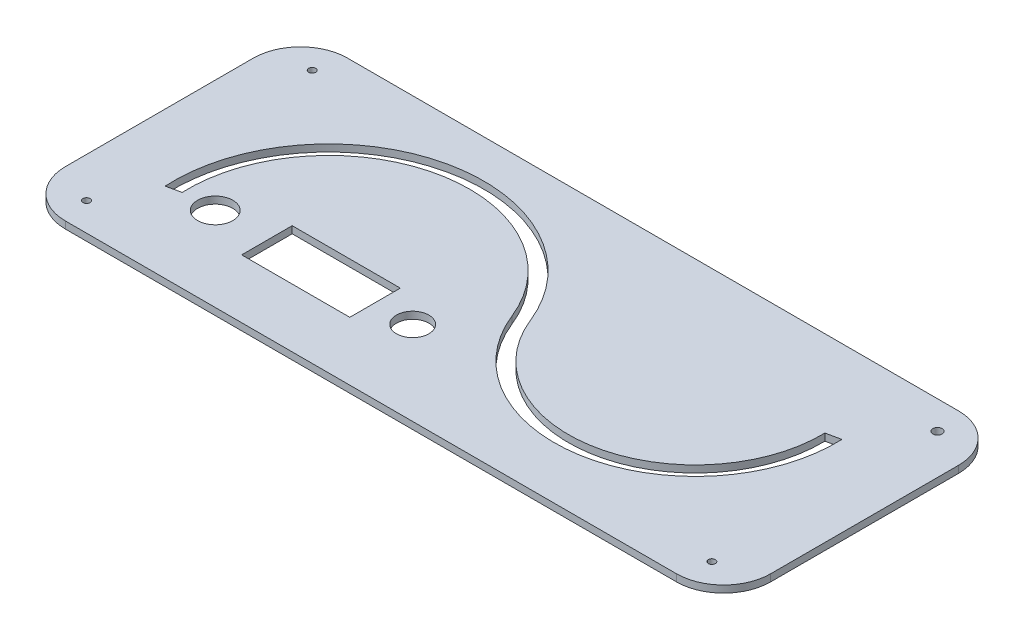
ISO-10303-21;
HEADER;
FILE_DESCRIPTION(('STEP AP214'),'2;1');
FILE_NAME('part.step','',(''),(''),'','','');
FILE_SCHEMA(('AUTOMOTIVE_DESIGN { 1 0 10303 214 1 1 1 1 }'));
ENDSEC;
DATA;
#1=APPLICATION_CONTEXT('core data for automotive mechanical design processes');
#2=APPLICATION_PROTOCOL_DEFINITION('international standard','automotive_design',2000,#1);
#3=PRODUCT_CONTEXT('',#1,'mechanical');
#4=PRODUCT('Part','Part','',(#3));
#5=PRODUCT_RELATED_PRODUCT_CATEGORY('part','',(#4));
#6=PRODUCT_DEFINITION_FORMATION('','',#4);
#7=PRODUCT_DEFINITION_CONTEXT('part definition',#1,'design');
#8=PRODUCT_DEFINITION('design','',#6,#7);
#9=PRODUCT_DEFINITION_SHAPE('','',#8);
#10=(LENGTH_UNIT() NAMED_UNIT(*) SI_UNIT(.MILLI.,.METRE.));
#11=(NAMED_UNIT(*) PLANE_ANGLE_UNIT() SI_UNIT($,.RADIAN.));
#12=(NAMED_UNIT(*) SI_UNIT($,.STERADIAN.) SOLID_ANGLE_UNIT());
#13=UNCERTAINTY_MEASURE_WITH_UNIT(LENGTH_MEASURE(1.E-05),#10,'distance_accuracy_value','');
#14=(GEOMETRIC_REPRESENTATION_CONTEXT(3) GLOBAL_UNCERTAINTY_ASSIGNED_CONTEXT((#13)) GLOBAL_UNIT_ASSIGNED_CONTEXT((#10,
#11,#12)) REPRESENTATION_CONTEXT('',''));
#15=CARTESIAN_POINT('',(0.,0.,0.));
#16=DIRECTION('',(0.,0.,1.));
#17=DIRECTION('',(1.,0.,0.));
#18=AXIS2_PLACEMENT_3D('',#15,#16,#17);
#19=CARTESIAN_POINT('',(0.,3.,0.));
#20=DIRECTION('',(0.,1.,0.));
#21=DIRECTION('',(0.,0.,1.));
#22=AXIS2_PLACEMENT_3D('',#19,#20,#21);
#23=PLANE('',#22);
#24=CARTESIAN_POINT('',(-168.,3.,-35.7464857041005));
#25=DIRECTION('',(0.,1.,0.));
#26=DIRECTION('',(0.,0.,1.));
#27=AXIS2_PLACEMENT_3D('',#24,#25,#26);
#28=CIRCLE('',#27,6.89999999999999);
#29=CARTESIAN_POINT('',(-168.,3.,-28.8464857041005));
#30=VERTEX_POINT('',#29);
#31=EDGE_CURVE('E196',#30,#30,#28,.T.);
#32=ORIENTED_EDGE('',*,*,#31,.F.);
#33=EDGE_LOOP('',(#32));
#34=FACE_BOUND('',#33,.T.);
#35=CARTESIAN_POINT('',(-17.,3.,-12.0000000000001));
#36=DIRECTION('',(0.,1.,0.));
#37=DIRECTION('',(0.,0.,1.));
#38=AXIS2_PLACEMENT_3D('',#35,#36,#37);
#39=CIRCLE('',#38,1.5);
#40=CARTESIAN_POINT('',(-17.,3.,-10.5000000000001));
#41=VERTEX_POINT('',#40);
#42=EDGE_CURVE('E258',#41,#41,#39,.T.);
#43=ORIENTED_EDGE('',*,*,#42,.F.);
#44=EDGE_LOOP('',(#43));
#45=FACE_BOUND('',#44,.T.);
#46=CARTESIAN_POINT('',(-283.,3.,-108.));
#47=DIRECTION('',(0.,1.,0.));
#48=DIRECTION('',(0.,0.,1.));
#49=AXIS2_PLACEMENT_3D('',#46,#47,#48);
#50=CIRCLE('',#49,1.50000000000002);
#51=CARTESIAN_POINT('',(-283.,3.,-106.5));
#52=VERTEX_POINT('',#51);
#53=EDGE_CURVE('E270',#52,#52,#50,.T.);
#54=ORIENTED_EDGE('',*,*,#53,.F.);
#55=EDGE_LOOP('',(#54));
#56=FACE_BOUND('',#55,.T.);
#57=DIRECTION('',(1.,0.,0.));
#58=VECTOR('',#57,1.);
#59=CARTESIAN_POINT('',(0.,3.,0.));
#60=LINE('',#59,#58);
#61=CARTESIAN_POINT('',(-280.,3.,0.));
#62=VERTEX_POINT('',#61);
#63=CARTESIAN_POINT('',(-20.,3.,0.));
#64=VERTEX_POINT('',#63);
#65=EDGE_CURVE('E284',#62,#64,#60,.T.);
#66=ORIENTED_EDGE('',*,*,#65,.T.);
#67=CARTESIAN_POINT('',(-20.,3.,-20.));
#68=DIRECTION('',(0.,1.,0.));
#69=DIRECTION('',(0.,0.,1.));
#70=AXIS2_PLACEMENT_3D('',#67,#68,#69);
#71=CIRCLE('',#70,20.);
#72=CARTESIAN_POINT('',(0.,3.,-20.));
#73=VERTEX_POINT('',#72);
#74=EDGE_CURVE('E319',#64,#73,#71,.T.);
#75=ORIENTED_EDGE('',*,*,#74,.T.);
#76=DIRECTION('',(0.,0.,-1.));
#77=VECTOR('',#76,1.);
#78=CARTESIAN_POINT('',(0.,3.,0.));
#79=LINE('',#78,#77);
#80=CARTESIAN_POINT('',(0.,3.,-100.));
#81=VERTEX_POINT('',#80);
#82=EDGE_CURVE('E276',#73,#81,#79,.T.);
#83=ORIENTED_EDGE('',*,*,#82,.T.);
#84=CARTESIAN_POINT('',(-20.,3.,-100.));
#85=DIRECTION('',(0.,1.,0.));
#86=DIRECTION('',(0.,0.,1.));
#87=AXIS2_PLACEMENT_3D('',#84,#85,#86);
#88=CIRCLE('',#87,20.);
#89=CARTESIAN_POINT('',(-20.,3.,-120.));
#90=VERTEX_POINT('',#89);
#91=EDGE_CURVE('E317',#81,#90,#88,.T.);
#92=ORIENTED_EDGE('',*,*,#91,.T.);
#93=DIRECTION('',(-1.,0.,0.));
#94=VECTOR('',#93,1.);
#95=CARTESIAN_POINT('',(0.,3.,-120.));
#96=LINE('',#95,#94);
#97=CARTESIAN_POINT('',(-280.,3.,-120.));
#98=VERTEX_POINT('',#97);
#99=EDGE_CURVE('E279',#90,#98,#96,.T.);
#100=ORIENTED_EDGE('',*,*,#99,.T.);
#101=CARTESIAN_POINT('',(-280.,3.,-100.));
#102=DIRECTION('',(0.,1.,0.));
#103=DIRECTION('',(0.,0.,1.));
#104=AXIS2_PLACEMENT_3D('',#101,#102,#103);
#105=CIRCLE('',#104,20.);
#106=CARTESIAN_POINT('',(-300.,3.,-100.));
#107=VERTEX_POINT('',#106);
#108=EDGE_CURVE('E57',#98,#107,#105,.T.);
#109=ORIENTED_EDGE('',*,*,#108,.T.);
#110=DIRECTION('',(0.,0.,1.));
#111=VECTOR('',#110,1.);
#112=CARTESIAN_POINT('',(-300.,3.,0.));
#113=LINE('',#112,#111);
#114=CARTESIAN_POINT('',(-300.,3.,-20.));
#115=VERTEX_POINT('',#114);
#116=EDGE_CURVE('E282',#107,#115,#113,.T.);
#117=ORIENTED_EDGE('',*,*,#116,.T.);
#118=CARTESIAN_POINT('',(-280.,3.,-20.));
#119=DIRECTION('',(0.,1.,0.));
#120=DIRECTION('',(0.,0.,1.));
#121=AXIS2_PLACEMENT_3D('',#118,#119,#120);
#122=CIRCLE('',#121,20.);
#123=EDGE_CURVE('E314',#115,#62,#122,.T.);
#124=ORIENTED_EDGE('',*,*,#123,.T.);
#125=EDGE_LOOP('',(#66,#75,#83,#92,#100,#109,#117,#124));
#126=FACE_BOUND('',#125,.T.);
#127=CARTESIAN_POINT('',(-17.,3.,-108.));
#128=DIRECTION('',(0.,1.,0.));
#129=DIRECTION('',(0.,0.,1.));
#130=AXIS2_PLACEMENT_3D('',#127,#128,#129);
#131=CIRCLE('',#130,2.);
#132=CARTESIAN_POINT('',(-17.,3.,-106.));
#133=VERTEX_POINT('',#132);
#134=EDGE_CURVE('E264',#133,#133,#131,.T.);
#135=ORIENTED_EDGE('',*,*,#134,.F.);
#136=EDGE_LOOP('',(#135));
#137=FACE_BOUND('',#136,.T.);
#138=CARTESIAN_POINT('',(-283.,3.,-12.));
#139=DIRECTION('',(0.,1.,0.));
#140=DIRECTION('',(0.,0.,1.));
#141=AXIS2_PLACEMENT_3D('',#138,#139,#140);
#142=CIRCLE('',#141,1.50000000000002);
#143=CARTESIAN_POINT('',(-283.,3.,-10.5));
#144=VERTEX_POINT('',#143);
#145=EDGE_CURVE('E252',#144,#144,#142,.T.);
#146=ORIENTED_EDGE('',*,*,#145,.F.);
#147=EDGE_LOOP('',(#146));
#148=FACE_BOUND('',#147,.T.);
#149=DIRECTION('',(0.977992836424308,0.,-0.208638471770518));
#150=VECTOR('',#149,1.);
#151=CARTESIAN_POINT('',(-271.607074704314,3.,-34.057157396413));
#152=LINE('',#151,#150);
#153=CARTESIAN_POINT('',(-271.607074704314,3.,-34.057157396413));
#154=VERTEX_POINT('',#153);
#155=CARTESIAN_POINT('',(-265.660946053824,3.,-35.3256648418508));
#156=VERTEX_POINT('',#155);
#157=EDGE_CURVE('E209',#154,#156,#152,.T.);
#158=ORIENTED_EDGE('',*,*,#157,.F.);
#159=CARTESIAN_POINT('',(-205.708601453116,3.,-37.7165594187538));
#160=DIRECTION('',(0.,1.,0.));
#161=DIRECTION('',(0.,0.,1.));
#162=AXIS2_PLACEMENT_3D('',#159,#160,#161);
#163=CIRCLE('',#162,66.);
#164=CARTESIAN_POINT('',(-144.429139854688,3.,-62.2283440581246));
#165=VERTEX_POINT('',#164);
#166=EDGE_CURVE('E207',#165,#154,#163,.T.);
#167=ORIENTED_EDGE('',*,*,#166,.F.);
#168=CARTESIAN_POINT('',(-94.2913985468845,3.,-82.2834405812462));
#169=DIRECTION('',(0.,-1.,0.));
#170=DIRECTION('',(0.,0.,1.));
#171=AXIS2_PLACEMENT_3D('',#168,#169,#170);
#172=CIRCLE('',#171,54.);
#173=CARTESIAN_POINT('',(-40.3029853623549,3.,-83.4020297893643));
#174=VERTEX_POINT('',#173);
#175=EDGE_CURVE('E219',#174,#165,#172,.T.);
#176=ORIENTED_EDGE('',*,*,#175,.F.);
#177=DIRECTION('',(-0.977992836424307,0.,0.20863847177052));
#178=VECTOR('',#177,1.);
#179=CARTESIAN_POINT('',(-40.3029853623549,3.,-83.4020297893643));
#180=LINE('',#179,#178);
#181=CARTESIAN_POINT('',(-34.3390539461757,3.,-84.6743351581492));
#182=VERTEX_POINT('',#181);
#183=EDGE_CURVE('E216',#182,#174,#180,.T.);
#184=ORIENTED_EDGE('',*,*,#183,.F.);
#185=CARTESIAN_POINT('',(-94.2913985468845,3.,-82.2834405812462));
#186=DIRECTION('',(0.,1.,0.));
#187=DIRECTION('',(0.,0.,1.));
#188=AXIS2_PLACEMENT_3D('',#185,#186,#187);
#189=CIRCLE('',#188,60.);
#190=CARTESIAN_POINT('',(-150.,3.,-60.));
#191=VERTEX_POINT('',#190);
#192=EDGE_CURVE('E214',#191,#182,#189,.T.);
#193=ORIENTED_EDGE('',*,*,#192,.F.);
#194=CARTESIAN_POINT('',(-205.708601453116,3.,-37.7165594187538));
#195=DIRECTION('',(0.,-1.,0.));
#196=DIRECTION('',(0.,0.,1.));
#197=AXIS2_PLACEMENT_3D('',#194,#195,#196);
#198=CIRCLE('',#197,60.);
#199=EDGE_CURVE('E212',#156,#191,#198,.T.);
#200=ORIENTED_EDGE('',*,*,#199,.F.);
#201=EDGE_LOOP('',(#158,#167,#176,#184,#193,#200));
#202=FACE_BOUND('',#201,.T.);
#203=DIRECTION('',(-1.,0.,0.));
#204=VECTOR('',#203,1.);
#205=CARTESIAN_POINT('',(-230.,3.,-46.4964857041005));
#206=LINE('',#205,#204);
#207=CARTESIAN_POINT('',(-184.,3.,-46.4964857041005));
#208=VERTEX_POINT('',#207);
#209=CARTESIAN_POINT('',(-230.,3.,-46.4964857041005));
#210=VERTEX_POINT('',#209);
#211=EDGE_CURVE('E173',#208,#210,#206,.T.);
#212=ORIENTED_EDGE('',*,*,#211,.F.);
#213=DIRECTION('',(0.,0.,-1.));
#214=VECTOR('',#213,1.);
#215=CARTESIAN_POINT('',(-184.,3.,-46.4964857041005));
#216=LINE('',#215,#214);
#217=CARTESIAN_POINT('',(-184.,3.,-24.9964857041005));
#218=VERTEX_POINT('',#217);
#219=EDGE_CURVE('E163',#218,#208,#216,.T.);
#220=ORIENTED_EDGE('',*,*,#219,.F.);
#221=DIRECTION('',(1.,0.,0.));
#222=VECTOR('',#221,1.);
#223=CARTESIAN_POINT('',(-230.,3.,-24.9964857041005));
#224=LINE('',#223,#222);
#225=CARTESIAN_POINT('',(-230.,3.,-24.9964857041005));
#226=VERTEX_POINT('',#225);
#227=EDGE_CURVE('E189',#226,#218,#224,.T.);
#228=ORIENTED_EDGE('',*,*,#227,.F.);
#229=DIRECTION('',(0.,0.,1.));
#230=VECTOR('',#229,1.);
#231=CARTESIAN_POINT('',(-230.,3.,-46.4964857041005));
#232=LINE('',#231,#230);
#233=EDGE_CURVE('E187',#210,#226,#232,.T.);
#234=ORIENTED_EDGE('',*,*,#233,.F.);
#235=EDGE_LOOP('',(#212,#220,#228,#234));
#236=FACE_BOUND('',#235,.T.);
#237=CARTESIAN_POINT('',(-252.,3.,-35.7464857041005));
#238=DIRECTION('',(0.,1.,0.));
#239=DIRECTION('',(0.,0.,1.));
#240=AXIS2_PLACEMENT_3D('',#237,#238,#239);
#241=CIRCLE('',#240,7.50000000000001);
#242=CARTESIAN_POINT('',(-252.,3.,-28.2464857041005));
#243=VERTEX_POINT('',#242);
#244=EDGE_CURVE('E601',#243,#243,#241,.T.);
#245=ORIENTED_EDGE('',*,*,#244,.F.);
#246=EDGE_LOOP('',(#245));
#247=FACE_BOUND('',#246,.T.);
#248=ADVANCED_FACE('F36',(#34,#45,#56,#126,#137,#148,#202,#236,#247),#23,.T.);
#249=CARTESIAN_POINT('',(0.,0.,0.));
#250=DIRECTION('',(0.,1.,0.));
#251=DIRECTION('',(0.,0.,1.));
#252=AXIS2_PLACEMENT_3D('',#249,#250,#251);
#253=PLANE('',#252);
#254=CARTESIAN_POINT('',(-205.708601453116,0.,-37.7165594187538));
#255=DIRECTION('',(0.,1.,0.));
#256=DIRECTION('',(0.,0.,1.));
#257=AXIS2_PLACEMENT_3D('',#254,#255,#256);
#258=CIRCLE('',#257,66.);
#259=CARTESIAN_POINT('',(-144.429139854688,0.,-62.2283440581246));
#260=VERTEX_POINT('',#259);
#261=CARTESIAN_POINT('',(-271.607074704314,0.,-34.057157396413));
#262=VERTEX_POINT('',#261);
#263=EDGE_CURVE('E181',#260,#262,#258,.T.);
#264=ORIENTED_EDGE('',*,*,#263,.T.);
#265=DIRECTION('',(0.977992836424308,0.,-0.208638471770518));
#266=VECTOR('',#265,1.);
#267=CARTESIAN_POINT('',(-271.607074704314,0.,-34.057157396413));
#268=LINE('',#267,#266);
#269=CARTESIAN_POINT('',(-265.660946053824,0.,-35.3256648418508));
#270=VERTEX_POINT('',#269);
#271=EDGE_CURVE('E224',#262,#270,#268,.T.);
#272=ORIENTED_EDGE('',*,*,#271,.T.);
#273=CARTESIAN_POINT('',(-205.708601453116,0.,-37.7165594187538));
#274=DIRECTION('',(0.,-1.,0.));
#275=DIRECTION('',(0.,0.,1.));
#276=AXIS2_PLACEMENT_3D('',#273,#274,#275);
#277=CIRCLE('',#276,60.);
#278=CARTESIAN_POINT('',(-150.,0.,-60.));
#279=VERTEX_POINT('',#278);
#280=EDGE_CURVE('E227',#270,#279,#277,.T.);
#281=ORIENTED_EDGE('',*,*,#280,.T.);
#282=CARTESIAN_POINT('',(-94.2913985468845,0.,-82.2834405812462));
#283=DIRECTION('',(0.,1.,0.));
#284=DIRECTION('',(0.,0.,1.));
#285=AXIS2_PLACEMENT_3D('',#282,#283,#284);
#286=CIRCLE('',#285,60.);
#287=CARTESIAN_POINT('',(-34.3390539461757,0.,-84.6743351581492));
#288=VERTEX_POINT('',#287);
#289=EDGE_CURVE('E230',#279,#288,#286,.T.);
#290=ORIENTED_EDGE('',*,*,#289,.T.);
#291=DIRECTION('',(-0.977992836424307,0.,0.20863847177052));
#292=VECTOR('',#291,1.);
#293=CARTESIAN_POINT('',(-40.3029853623549,0.,-83.4020297893643));
#294=LINE('',#293,#292);
#295=CARTESIAN_POINT('',(-40.3029853623549,0.,-83.4020297893643));
#296=VERTEX_POINT('',#295);
#297=EDGE_CURVE('E233',#288,#296,#294,.T.);
#298=ORIENTED_EDGE('',*,*,#297,.T.);
#299=CARTESIAN_POINT('',(-94.2913985468845,0.,-82.2834405812462));
#300=DIRECTION('',(0.,-1.,0.));
#301=DIRECTION('',(0.,0.,1.));
#302=AXIS2_PLACEMENT_3D('',#299,#300,#301);
#303=CIRCLE('',#302,54.);
#304=EDGE_CURVE('E210',#296,#260,#303,.T.);
#305=ORIENTED_EDGE('',*,*,#304,.T.);
#306=EDGE_LOOP('',(#264,#272,#281,#290,#298,#305));
#307=FACE_BOUND('',#306,.T.);
#308=DIRECTION('',(0.,0.,-1.));
#309=VECTOR('',#308,1.);
#310=CARTESIAN_POINT('',(0.,0.,0.));
#311=LINE('',#310,#309);
#312=CARTESIAN_POINT('',(0.,0.,-20.));
#313=VERTEX_POINT('',#312);
#314=CARTESIAN_POINT('',(0.,0.,-100.));
#315=VERTEX_POINT('',#314);
#316=EDGE_CURVE('E273',#313,#315,#311,.T.);
#317=ORIENTED_EDGE('',*,*,#316,.F.);
#318=CARTESIAN_POINT('',(-20.,0.,-20.));
#319=DIRECTION('',(0.,1.,0.));
#320=DIRECTION('',(0.,0.,1.));
#321=AXIS2_PLACEMENT_3D('',#318,#319,#320);
#322=CIRCLE('',#321,20.);
#323=CARTESIAN_POINT('',(-20.,0.,0.));
#324=VERTEX_POINT('',#323);
#325=EDGE_CURVE('E307',#313,#324,#322,.F.);
#326=ORIENTED_EDGE('',*,*,#325,.T.);
#327=DIRECTION('',(1.,0.,0.));
#328=VECTOR('',#327,1.);
#329=CARTESIAN_POINT('',(0.,0.,0.));
#330=LINE('',#329,#328);
#331=CARTESIAN_POINT('',(-280.,0.,0.));
#332=VERTEX_POINT('',#331);
#333=EDGE_CURVE('E280',#332,#324,#330,.T.);
#334=ORIENTED_EDGE('',*,*,#333,.F.);
#335=CARTESIAN_POINT('',(-280.,0.,-20.));
#336=DIRECTION('',(0.,1.,0.));
#337=DIRECTION('',(0.,0.,1.));
#338=AXIS2_PLACEMENT_3D('',#335,#336,#337);
#339=CIRCLE('',#338,20.);
#340=CARTESIAN_POINT('',(-300.,0.,-20.));
#341=VERTEX_POINT('',#340);
#342=EDGE_CURVE('E301',#332,#341,#339,.F.);
#343=ORIENTED_EDGE('',*,*,#342,.T.);
#344=DIRECTION('',(0.,0.,1.));
#345=VECTOR('',#344,1.);
#346=CARTESIAN_POINT('',(-300.,0.,0.));
#347=LINE('',#346,#345);
#348=CARTESIAN_POINT('',(-300.,0.,-100.));
#349=VERTEX_POINT('',#348);
#350=EDGE_CURVE('E293',#349,#341,#347,.T.);
#351=ORIENTED_EDGE('',*,*,#350,.F.);
#352=CARTESIAN_POINT('',(-280.,0.,-100.));
#353=DIRECTION('',(0.,1.,0.));
#354=DIRECTION('',(0.,0.,1.));
#355=AXIS2_PLACEMENT_3D('',#352,#353,#354);
#356=CIRCLE('',#355,20.);
#357=CARTESIAN_POINT('',(-280.,0.,-120.));
#358=VERTEX_POINT('',#357);
#359=EDGE_CURVE('E303',#349,#358,#356,.F.);
#360=ORIENTED_EDGE('',*,*,#359,.T.);
#361=DIRECTION('',(-1.,0.,0.));
#362=VECTOR('',#361,1.);
#363=CARTESIAN_POINT('',(0.,0.,-120.));
#364=LINE('',#363,#362);
#365=CARTESIAN_POINT('',(-20.,0.,-120.));
#366=VERTEX_POINT('',#365);
#367=EDGE_CURVE('E290',#366,#358,#364,.T.);
#368=ORIENTED_EDGE('',*,*,#367,.F.);
#369=CARTESIAN_POINT('',(-20.,0.,-100.));
#370=DIRECTION('',(0.,1.,0.));
#371=DIRECTION('',(0.,0.,1.));
#372=AXIS2_PLACEMENT_3D('',#369,#370,#371);
#373=CIRCLE('',#372,20.);
#374=EDGE_CURVE('E305',#366,#315,#373,.F.);
#375=ORIENTED_EDGE('',*,*,#374,.T.);
#376=EDGE_LOOP('',(#317,#326,#334,#343,#351,#360,#368,#375));
#377=FACE_BOUND('',#376,.T.);
#378=CARTESIAN_POINT('',(-283.,0.,-108.));
#379=DIRECTION('',(0.,1.,0.));
#380=DIRECTION('',(0.,0.,1.));
#381=AXIS2_PLACEMENT_3D('',#378,#379,#380);
#382=CIRCLE('',#381,1.50000000000002);
#383=CARTESIAN_POINT('',(-283.,0.,-106.5));
#384=VERTEX_POINT('',#383);
#385=EDGE_CURVE('E267',#384,#384,#382,.T.);
#386=ORIENTED_EDGE('',*,*,#385,.T.);
#387=EDGE_LOOP('',(#386));
#388=FACE_BOUND('',#387,.T.);
#389=CARTESIAN_POINT('',(-17.,0.,-108.));
#390=DIRECTION('',(0.,1.,0.));
#391=DIRECTION('',(0.,0.,1.));
#392=AXIS2_PLACEMENT_3D('',#389,#390,#391);
#393=CIRCLE('',#392,2.);
#394=CARTESIAN_POINT('',(-17.,0.,-106.));
#395=VERTEX_POINT('',#394);
#396=EDGE_CURVE('E261',#395,#395,#393,.T.);
#397=ORIENTED_EDGE('',*,*,#396,.T.);
#398=EDGE_LOOP('',(#397));
#399=FACE_BOUND('',#398,.T.);
#400=CARTESIAN_POINT('',(-17.,0.,-12.0000000000001));
#401=DIRECTION('',(0.,1.,0.));
#402=DIRECTION('',(0.,0.,1.));
#403=AXIS2_PLACEMENT_3D('',#400,#401,#402);
#404=CIRCLE('',#403,1.5);
#405=CARTESIAN_POINT('',(-17.,0.,-10.5000000000001));
#406=VERTEX_POINT('',#405);
#407=EDGE_CURVE('E255',#406,#406,#404,.T.);
#408=ORIENTED_EDGE('',*,*,#407,.T.);
#409=EDGE_LOOP('',(#408));
#410=FACE_BOUND('',#409,.T.);
#411=CARTESIAN_POINT('',(-283.,0.,-12.));
#412=DIRECTION('',(0.,1.,0.));
#413=DIRECTION('',(0.,0.,1.));
#414=AXIS2_PLACEMENT_3D('',#411,#412,#413);
#415=CIRCLE('',#414,1.50000000000002);
#416=CARTESIAN_POINT('',(-283.,0.,-10.5));
#417=VERTEX_POINT('',#416);
#418=EDGE_CURVE('E251',#417,#417,#415,.T.);
#419=ORIENTED_EDGE('',*,*,#418,.T.);
#420=EDGE_LOOP('',(#419));
#421=FACE_BOUND('',#420,.T.);
#422=DIRECTION('',(0.,0.,-1.));
#423=VECTOR('',#422,1.);
#424=CARTESIAN_POINT('',(-184.,0.,-46.4964857041005));
#425=LINE('',#424,#423);
#426=CARTESIAN_POINT('',(-184.,0.,-24.9964857041005));
#427=VERTEX_POINT('',#426);
#428=CARTESIAN_POINT('',(-184.,0.,-46.4964857041005));
#429=VERTEX_POINT('',#428);
#430=EDGE_CURVE('E194',#427,#429,#425,.T.);
#431=ORIENTED_EDGE('',*,*,#430,.T.);
#432=DIRECTION('',(-1.,0.,0.));
#433=VECTOR('',#432,1.);
#434=CARTESIAN_POINT('',(-230.,0.,-46.4964857041005));
#435=LINE('',#434,#433);
#436=CARTESIAN_POINT('',(-230.,0.,-46.4964857041005));
#437=VERTEX_POINT('',#436);
#438=EDGE_CURVE('E180',#429,#437,#435,.T.);
#439=ORIENTED_EDGE('',*,*,#438,.T.);
#440=DIRECTION('',(0.,0.,1.));
#441=VECTOR('',#440,1.);
#442=CARTESIAN_POINT('',(-230.,0.,-46.4964857041005));
#443=LINE('',#442,#441);
#444=CARTESIAN_POINT('',(-230.,0.,-24.9964857041005));
#445=VERTEX_POINT('',#444);
#446=EDGE_CURVE('E198',#437,#445,#443,.T.);
#447=ORIENTED_EDGE('',*,*,#446,.T.);
#448=DIRECTION('',(1.,0.,0.));
#449=VECTOR('',#448,1.);
#450=CARTESIAN_POINT('',(-230.,0.,-24.9964857041005));
#451=LINE('',#450,#449);
#452=EDGE_CURVE('E174',#445,#427,#451,.T.);
#453=ORIENTED_EDGE('',*,*,#452,.T.);
#454=EDGE_LOOP('',(#431,#439,#447,#453));
#455=FACE_BOUND('',#454,.T.);
#456=CARTESIAN_POINT('',(-168.,0.,-35.7464857041005));
#457=DIRECTION('',(0.,1.,0.));
#458=DIRECTION('',(0.,0.,1.));
#459=AXIS2_PLACEMENT_3D('',#456,#457,#458);
#460=CIRCLE('',#459,6.89999999999999);
#461=CARTESIAN_POINT('',(-168.,0.,-28.8464857041005));
#462=VERTEX_POINT('',#461);
#463=EDGE_CURVE('E607',#462,#462,#460,.T.);
#464=ORIENTED_EDGE('',*,*,#463,.T.);
#465=EDGE_LOOP('',(#464));
#466=FACE_BOUND('',#465,.T.);
#467=CARTESIAN_POINT('',(-252.,0.,-35.7464857041005));
#468=DIRECTION('',(0.,1.,0.));
#469=DIRECTION('',(0.,0.,1.));
#470=AXIS2_PLACEMENT_3D('',#467,#468,#469);
#471=CIRCLE('',#470,7.50000000000001);
#472=CARTESIAN_POINT('',(-252.,0.,-28.2464857041005));
#473=VERTEX_POINT('',#472);
#474=EDGE_CURVE('E604',#473,#473,#471,.T.);
#475=ORIENTED_EDGE('',*,*,#474,.T.);
#476=EDGE_LOOP('',(#475));
#477=FACE_BOUND('',#476,.T.);
#478=ADVANCED_FACE('F335',(#307,#377,#388,#399,#410,#421,#455,#466,#477),#253,.F.);
#479=CARTESIAN_POINT('',(0.,3.,0.));
#480=DIRECTION('',(-1.,0.,0.));
#481=DIRECTION('',(0.,0.,1.));
#482=AXIS2_PLACEMENT_3D('',#479,#480,#481);
#483=PLANE('',#482);
#484=ORIENTED_EDGE('',*,*,#82,.F.);
#485=DIRECTION('',(0.,-1.,0.));
#486=VECTOR('',#485,1.);
#487=CARTESIAN_POINT('',(0.,3.,-20.));
#488=LINE('',#487,#486);
#489=EDGE_CURVE('E298',#73,#313,#488,.T.);
#490=ORIENTED_EDGE('',*,*,#489,.T.);
#491=ORIENTED_EDGE('',*,*,#316,.T.);
#492=DIRECTION('',(0.,-1.,0.));
#493=VECTOR('',#492,1.);
#494=CARTESIAN_POINT('',(0.,3.,-100.));
#495=LINE('',#494,#493);
#496=EDGE_CURVE('E287',#315,#81,#495,.F.);
#497=ORIENTED_EDGE('',*,*,#496,.T.);
#498=EDGE_LOOP('',(#484,#490,#491,#497));
#499=FACE_BOUND('',#498,.T.);
#500=ADVANCED_FACE('F357',(#499),#483,.F.);
#501=CARTESIAN_POINT('',(0.,3.,-120.));
#502=DIRECTION('',(0.,0.,1.));
#503=DIRECTION('',(1.,0.,0.));
#504=AXIS2_PLACEMENT_3D('',#501,#502,#503);
#505=PLANE('',#504);
#506=ORIENTED_EDGE('',*,*,#99,.F.);
#507=DIRECTION('',(0.,-1.,0.));
#508=VECTOR('',#507,1.);
#509=CARTESIAN_POINT('',(-20.,3.,-120.));
#510=LINE('',#509,#508);
#511=EDGE_CURVE('E323',#90,#366,#510,.T.);
#512=ORIENTED_EDGE('',*,*,#511,.T.);
#513=ORIENTED_EDGE('',*,*,#367,.T.);
#514=DIRECTION('',(0.,-1.,0.));
#515=VECTOR('',#514,1.);
#516=CARTESIAN_POINT('',(-280.,3.,-120.));
#517=LINE('',#516,#515);
#518=EDGE_CURVE('E321',#358,#98,#517,.F.);
#519=ORIENTED_EDGE('',*,*,#518,.T.);
#520=EDGE_LOOP('',(#506,#512,#513,#519));
#521=FACE_BOUND('',#520,.T.);
#522=ADVANCED_FACE('F329',(#521),#505,.F.);
#523=CARTESIAN_POINT('',(-300.,3.,0.));
#524=DIRECTION('',(1.,0.,0.));
#525=DIRECTION('',(0.,0.,-1.));
#526=AXIS2_PLACEMENT_3D('',#523,#524,#525);
#527=PLANE('',#526);
#528=ORIENTED_EDGE('',*,*,#116,.F.);
#529=DIRECTION('',(0.,-1.,0.));
#530=VECTOR('',#529,1.);
#531=CARTESIAN_POINT('',(-300.,3.,-100.));
#532=LINE('',#531,#530);
#533=EDGE_CURVE('E11',#107,#349,#532,.T.);
#534=ORIENTED_EDGE('',*,*,#533,.T.);
#535=ORIENTED_EDGE('',*,*,#350,.T.);
#536=DIRECTION('',(0.,-1.,0.));
#537=VECTOR('',#536,1.);
#538=CARTESIAN_POINT('',(-300.,3.,-20.));
#539=LINE('',#538,#537);
#540=EDGE_CURVE('E44',#341,#115,#539,.F.);
#541=ORIENTED_EDGE('',*,*,#540,.T.);
#542=EDGE_LOOP('',(#528,#534,#535,#541));
#543=FACE_BOUND('',#542,.T.);
#544=ADVANCED_FACE('F341',(#543),#527,.F.);
#545=CARTESIAN_POINT('',(0.,3.,0.));
#546=DIRECTION('',(0.,0.,-1.));
#547=DIRECTION('',(-1.,0.,0.));
#548=AXIS2_PLACEMENT_3D('',#545,#546,#547);
#549=PLANE('',#548);
#550=ORIENTED_EDGE('',*,*,#333,.T.);
#551=DIRECTION('',(0.,-1.,0.));
#552=VECTOR('',#551,1.);
#553=CARTESIAN_POINT('',(-20.,3.,0.));
#554=LINE('',#553,#552);
#555=EDGE_CURVE('E312',#324,#64,#554,.F.);
#556=ORIENTED_EDGE('',*,*,#555,.T.);
#557=ORIENTED_EDGE('',*,*,#65,.F.);
#558=DIRECTION('',(0.,-1.,0.));
#559=VECTOR('',#558,1.);
#560=CARTESIAN_POINT('',(-280.,3.,0.));
#561=LINE('',#560,#559);
#562=EDGE_CURVE('E309',#62,#332,#561,.T.);
#563=ORIENTED_EDGE('',*,*,#562,.T.);
#564=EDGE_LOOP('',(#550,#556,#557,#563));
#565=FACE_BOUND('',#564,.T.);
#566=ADVANCED_FACE('F349',(#565),#549,.F.);
#567=CARTESIAN_POINT('',(-283.,3.,-108.));
#568=DIRECTION('',(0.,-1.,0.));
#569=DIRECTION('',(0.,0.,-1.));
#570=AXIS2_PLACEMENT_3D('',#567,#568,#569);
#571=CYLINDRICAL_SURFACE('',#570,1.50000000000002);
#572=ORIENTED_EDGE('',*,*,#53,.T.);
#573=EDGE_LOOP('',(#572));
#574=FACE_BOUND('',#573,.T.);
#575=ORIENTED_EDGE('',*,*,#385,.F.);
#576=EDGE_LOOP('',(#575));
#577=FACE_BOUND('',#576,.T.);
#578=ADVANCED_FACE('F379',(#574,#577),#571,.F.);
#579=CARTESIAN_POINT('',(-17.,3.,-108.));
#580=DIRECTION('',(0.,-1.,0.));
#581=DIRECTION('',(0.,0.,-1.));
#582=AXIS2_PLACEMENT_3D('',#579,#580,#581);
#583=CYLINDRICAL_SURFACE('',#582,2.);
#584=ORIENTED_EDGE('',*,*,#134,.T.);
#585=EDGE_LOOP('',(#584));
#586=FACE_BOUND('',#585,.T.);
#587=ORIENTED_EDGE('',*,*,#396,.F.);
#588=EDGE_LOOP('',(#587));
#589=FACE_BOUND('',#588,.T.);
#590=ADVANCED_FACE('F412',(#586,#589),#583,.F.);
#591=CARTESIAN_POINT('',(-17.,3.,-12.0000000000001));
#592=DIRECTION('',(0.,-1.,0.));
#593=DIRECTION('',(0.,0.,-1.));
#594=AXIS2_PLACEMENT_3D('',#591,#592,#593);
#595=CYLINDRICAL_SURFACE('',#594,1.5);
#596=ORIENTED_EDGE('',*,*,#42,.T.);
#597=EDGE_LOOP('',(#596));
#598=FACE_BOUND('',#597,.T.);
#599=ORIENTED_EDGE('',*,*,#407,.F.);
#600=EDGE_LOOP('',(#599));
#601=FACE_BOUND('',#600,.T.);
#602=ADVANCED_FACE('F419',(#598,#601),#595,.F.);
#603=CARTESIAN_POINT('',(-283.,3.,-12.));
#604=DIRECTION('',(0.,-1.,0.));
#605=DIRECTION('',(0.,0.,-1.));
#606=AXIS2_PLACEMENT_3D('',#603,#604,#605);
#607=CYLINDRICAL_SURFACE('',#606,1.50000000000002);
#608=ORIENTED_EDGE('',*,*,#145,.T.);
#609=EDGE_LOOP('',(#608));
#610=FACE_BOUND('',#609,.T.);
#611=ORIENTED_EDGE('',*,*,#418,.F.);
#612=EDGE_LOOP('',(#611));
#613=FACE_BOUND('',#612,.T.);
#614=ADVANCED_FACE('F426',(#610,#613),#607,.F.);
#615=CARTESIAN_POINT('',(-205.708601453116,3.,-37.7165594187538));
#616=DIRECTION('',(0.,-1.,0.));
#617=DIRECTION('',(0.,0.,-1.));
#618=AXIS2_PLACEMENT_3D('',#615,#616,#617);
#619=CYLINDRICAL_SURFACE('',#618,66.);
#620=ORIENTED_EDGE('',*,*,#263,.F.);
#621=DIRECTION('',(0.,-1.,0.));
#622=VECTOR('',#621,1.);
#623=CARTESIAN_POINT('',(-144.429139854688,3.,-62.2283440581246));
#624=LINE('',#623,#622);
#625=EDGE_CURVE('E221',#165,#260,#624,.T.);
#626=ORIENTED_EDGE('',*,*,#625,.F.);
#627=ORIENTED_EDGE('',*,*,#166,.T.);
#628=DIRECTION('',(0.,-1.,0.));
#629=VECTOR('',#628,1.);
#630=CARTESIAN_POINT('',(-271.607074704314,3.,-34.057157396413));
#631=LINE('',#630,#629);
#632=EDGE_CURVE('E248',#154,#262,#631,.T.);
#633=ORIENTED_EDGE('',*,*,#632,.T.);
#634=EDGE_LOOP('',(#620,#626,#627,#633));
#635=FACE_BOUND('',#634,.T.);
#636=ADVANCED_FACE('F434',(#635),#619,.F.);
#637=CARTESIAN_POINT('',(-271.607074704314,3.,-34.057157396413));
#638=DIRECTION('',(-0.208638471770518,0.,-0.977992836424308));
#639=DIRECTION('',(-0.977992836424308,0.,0.208638471770518));
#640=AXIS2_PLACEMENT_3D('',#637,#638,#639);
#641=PLANE('',#640);
#642=ORIENTED_EDGE('',*,*,#271,.F.);
#643=ORIENTED_EDGE('',*,*,#632,.F.);
#644=ORIENTED_EDGE('',*,*,#157,.T.);
#645=DIRECTION('',(0.,-1.,0.));
#646=VECTOR('',#645,1.);
#647=CARTESIAN_POINT('',(-265.660946053824,3.,-35.3256648418508));
#648=LINE('',#647,#646);
#649=EDGE_CURVE('E246',#156,#270,#648,.T.);
#650=ORIENTED_EDGE('',*,*,#649,.T.);
#651=EDGE_LOOP('',(#642,#643,#644,#650));
#652=FACE_BOUND('',#651,.T.);
#653=ADVANCED_FACE('F442',(#652),#641,.T.);
#654=CARTESIAN_POINT('',(-205.708601453116,3.,-37.7165594187538));
#655=DIRECTION('',(0.,-1.,0.));
#656=DIRECTION('',(0.,0.,-1.));
#657=AXIS2_PLACEMENT_3D('',#654,#655,#656);
#658=CYLINDRICAL_SURFACE('',#657,60.);
#659=ORIENTED_EDGE('',*,*,#280,.F.);
#660=ORIENTED_EDGE('',*,*,#649,.F.);
#661=ORIENTED_EDGE('',*,*,#199,.T.);
#662=DIRECTION('',(0.,-1.,0.));
#663=VECTOR('',#662,1.);
#664=CARTESIAN_POINT('',(-150.,3.,-60.));
#665=LINE('',#664,#663);
#666=EDGE_CURVE('E244',#191,#279,#665,.T.);
#667=ORIENTED_EDGE('',*,*,#666,.T.);
#668=EDGE_LOOP('',(#659,#660,#661,#667));
#669=FACE_BOUND('',#668,.T.);
#670=ADVANCED_FACE('F450',(#669),#658,.T.);
#671=CARTESIAN_POINT('',(-94.2913985468845,3.,-82.2834405812462));
#672=DIRECTION('',(0.,-1.,0.));
#673=DIRECTION('',(0.,0.,-1.));
#674=AXIS2_PLACEMENT_3D('',#671,#672,#673);
#675=CYLINDRICAL_SURFACE('',#674,60.);
#676=ORIENTED_EDGE('',*,*,#289,.F.);
#677=ORIENTED_EDGE('',*,*,#666,.F.);
#678=ORIENTED_EDGE('',*,*,#192,.T.);
#679=DIRECTION('',(0.,-1.,0.));
#680=VECTOR('',#679,1.);
#681=CARTESIAN_POINT('',(-34.3390539461757,3.,-84.6743351581492));
#682=LINE('',#681,#680);
#683=EDGE_CURVE('E242',#182,#288,#682,.T.);
#684=ORIENTED_EDGE('',*,*,#683,.T.);
#685=EDGE_LOOP('',(#676,#677,#678,#684));
#686=FACE_BOUND('',#685,.T.);
#687=ADVANCED_FACE('F458',(#686),#675,.F.);
#688=CARTESIAN_POINT('',(-40.3029853623549,3.,-83.4020297893643));
#689=DIRECTION('',(0.20863847177052,0.,0.977992836424307));
#690=DIRECTION('',(0.977992836424307,0.,-0.20863847177052));
#691=AXIS2_PLACEMENT_3D('',#688,#689,#690);
#692=PLANE('',#691);
#693=ORIENTED_EDGE('',*,*,#297,.F.);
#694=ORIENTED_EDGE('',*,*,#683,.F.);
#695=ORIENTED_EDGE('',*,*,#183,.T.);
#696=DIRECTION('',(0.,-1.,0.));
#697=VECTOR('',#696,1.);
#698=CARTESIAN_POINT('',(-40.3029853623549,3.,-83.4020297893643));
#699=LINE('',#698,#697);
#700=EDGE_CURVE('E240',#174,#296,#699,.T.);
#701=ORIENTED_EDGE('',*,*,#700,.T.);
#702=EDGE_LOOP('',(#693,#694,#695,#701));
#703=FACE_BOUND('',#702,.T.);
#704=ADVANCED_FACE('F466',(#703),#692,.T.);
#705=CARTESIAN_POINT('',(-94.2913985468845,3.,-82.2834405812462));
#706=DIRECTION('',(0.,-1.,0.));
#707=DIRECTION('',(0.,0.,-1.));
#708=AXIS2_PLACEMENT_3D('',#705,#706,#707);
#709=CYLINDRICAL_SURFACE('',#708,54.);
#710=ORIENTED_EDGE('',*,*,#304,.F.);
#711=ORIENTED_EDGE('',*,*,#700,.F.);
#712=ORIENTED_EDGE('',*,*,#175,.T.);
#713=ORIENTED_EDGE('',*,*,#625,.T.);
#714=EDGE_LOOP('',(#710,#711,#712,#713));
#715=FACE_BOUND('',#714,.T.);
#716=ADVANCED_FACE('F474',(#715),#709,.T.);
#717=CARTESIAN_POINT('',(-184.,3.,-46.4964857041005));
#718=DIRECTION('',(-1.,0.,0.));
#719=DIRECTION('',(0.,0.,1.));
#720=AXIS2_PLACEMENT_3D('',#717,#718,#719);
#721=PLANE('',#720);
#722=ORIENTED_EDGE('',*,*,#430,.F.);
#723=DIRECTION('',(0.,-1.,0.));
#724=VECTOR('',#723,1.);
#725=CARTESIAN_POINT('',(-184.,3.,-24.9964857041005));
#726=LINE('',#725,#724);
#727=EDGE_CURVE('E169',#218,#427,#726,.T.);
#728=ORIENTED_EDGE('',*,*,#727,.F.);
#729=ORIENTED_EDGE('',*,*,#219,.T.);
#730=DIRECTION('',(0.,-1.,0.));
#731=VECTOR('',#730,1.);
#732=CARTESIAN_POINT('',(-184.,3.,-46.4964857041005));
#733=LINE('',#732,#731);
#734=EDGE_CURVE('E166',#208,#429,#733,.T.);
#735=ORIENTED_EDGE('',*,*,#734,.T.);
#736=EDGE_LOOP('',(#722,#728,#729,#735));
#737=FACE_BOUND('',#736,.T.);
#738=ADVANCED_FACE('F165',(#737),#721,.T.);
#739=CARTESIAN_POINT('',(-230.,3.,-46.4964857041005));
#740=DIRECTION('',(0.,0.,1.));
#741=DIRECTION('',(1.,0.,0.));
#742=AXIS2_PLACEMENT_3D('',#739,#740,#741);
#743=PLANE('',#742);
#744=ORIENTED_EDGE('',*,*,#438,.F.);
#745=ORIENTED_EDGE('',*,*,#734,.F.);
#746=ORIENTED_EDGE('',*,*,#211,.T.);
#747=DIRECTION('',(0.,-1.,0.));
#748=VECTOR('',#747,1.);
#749=CARTESIAN_POINT('',(-230.,3.,-46.4964857041005));
#750=LINE('',#749,#748);
#751=EDGE_CURVE('E182',#210,#437,#750,.T.);
#752=ORIENTED_EDGE('',*,*,#751,.T.);
#753=EDGE_LOOP('',(#744,#745,#746,#752));
#754=FACE_BOUND('',#753,.T.);
#755=ADVANCED_FACE('F177',(#754),#743,.T.);
#756=CARTESIAN_POINT('',(-230.,3.,-46.4964857041005));
#757=DIRECTION('',(1.,0.,0.));
#758=DIRECTION('',(0.,0.,-1.));
#759=AXIS2_PLACEMENT_3D('',#756,#757,#758);
#760=PLANE('',#759);
#761=ORIENTED_EDGE('',*,*,#446,.F.);
#762=ORIENTED_EDGE('',*,*,#751,.F.);
#763=ORIENTED_EDGE('',*,*,#233,.T.);
#764=DIRECTION('',(0.,-1.,0.));
#765=VECTOR('',#764,1.);
#766=CARTESIAN_POINT('',(-230.,3.,-24.9964857041005));
#767=LINE('',#766,#765);
#768=EDGE_CURVE('E204',#226,#445,#767,.T.);
#769=ORIENTED_EDGE('',*,*,#768,.T.);
#770=EDGE_LOOP('',(#761,#762,#763,#769));
#771=FACE_BOUND('',#770,.T.);
#772=ADVANCED_FACE('F495',(#771),#760,.T.);
#773=CARTESIAN_POINT('',(-230.,3.,-24.9964857041005));
#774=DIRECTION('',(0.,0.,-1.));
#775=DIRECTION('',(-1.,0.,0.));
#776=AXIS2_PLACEMENT_3D('',#773,#774,#775);
#777=PLANE('',#776);
#778=ORIENTED_EDGE('',*,*,#452,.F.);
#779=ORIENTED_EDGE('',*,*,#768,.F.);
#780=ORIENTED_EDGE('',*,*,#227,.T.);
#781=ORIENTED_EDGE('',*,*,#727,.T.);
#782=EDGE_LOOP('',(#778,#779,#780,#781));
#783=FACE_BOUND('',#782,.T.);
#784=ADVANCED_FACE('F502',(#783),#777,.T.);
#785=CARTESIAN_POINT('',(-168.,3.,-35.7464857041005));
#786=DIRECTION('',(0.,-1.,0.));
#787=DIRECTION('',(0.,0.,-1.));
#788=AXIS2_PLACEMENT_3D('',#785,#786,#787);
#789=CYLINDRICAL_SURFACE('',#788,6.89999999999999);
#790=ORIENTED_EDGE('',*,*,#31,.T.);
#791=EDGE_LOOP('',(#790));
#792=FACE_BOUND('',#791,.T.);
#793=ORIENTED_EDGE('',*,*,#463,.F.);
#794=EDGE_LOOP('',(#793));
#795=FACE_BOUND('',#794,.T.);
#796=ADVANCED_FACE('F510',(#792,#795),#789,.F.);
#797=CARTESIAN_POINT('',(-252.,3.,-35.7464857041005));
#798=DIRECTION('',(0.,-1.,0.));
#799=DIRECTION('',(0.,0.,-1.));
#800=AXIS2_PLACEMENT_3D('',#797,#798,#799);
#801=CYLINDRICAL_SURFACE('',#800,7.50000000000001);
#802=ORIENTED_EDGE('',*,*,#244,.T.);
#803=EDGE_LOOP('',(#802));
#804=FACE_BOUND('',#803,.T.);
#805=ORIENTED_EDGE('',*,*,#474,.F.);
#806=EDGE_LOOP('',(#805));
#807=FACE_BOUND('',#806,.T.);
#808=ADVANCED_FACE('F366',(#804,#807),#801,.F.);
#809=CARTESIAN_POINT('',(-20.,3.,-20.));
#810=DIRECTION('',(0.,-1.,0.));
#811=DIRECTION('',(0.,0.,-1.));
#812=AXIS2_PLACEMENT_3D('',#809,#810,#811);
#813=CYLINDRICAL_SURFACE('',#812,20.);
#814=ORIENTED_EDGE('',*,*,#74,.F.);
#815=ORIENTED_EDGE('',*,*,#555,.F.);
#816=ORIENTED_EDGE('',*,*,#325,.F.);
#817=ORIENTED_EDGE('',*,*,#489,.F.);
#818=EDGE_LOOP('',(#814,#815,#816,#817));
#819=FACE_BOUND('',#818,.T.);
#820=ADVANCED_FACE('F354',(#819),#813,.T.);
#821=CARTESIAN_POINT('',(-20.,3.,-100.));
#822=DIRECTION('',(0.,-1.,0.));
#823=DIRECTION('',(0.,0.,-1.));
#824=AXIS2_PLACEMENT_3D('',#821,#822,#823);
#825=CYLINDRICAL_SURFACE('',#824,20.);
#826=ORIENTED_EDGE('',*,*,#91,.F.);
#827=ORIENTED_EDGE('',*,*,#496,.F.);
#828=ORIENTED_EDGE('',*,*,#374,.F.);
#829=ORIENTED_EDGE('',*,*,#511,.F.);
#830=EDGE_LOOP('',(#826,#827,#828,#829));
#831=FACE_BOUND('',#830,.T.);
#832=ADVANCED_FACE('F359',(#831),#825,.T.);
#833=CARTESIAN_POINT('',(-280.,3.,-100.));
#834=DIRECTION('',(0.,-1.,0.));
#835=DIRECTION('',(0.,0.,-1.));
#836=AXIS2_PLACEMENT_3D('',#833,#834,#835);
#837=CYLINDRICAL_SURFACE('',#836,20.);
#838=ORIENTED_EDGE('',*,*,#108,.F.);
#839=ORIENTED_EDGE('',*,*,#518,.F.);
#840=ORIENTED_EDGE('',*,*,#359,.F.);
#841=ORIENTED_EDGE('',*,*,#533,.F.);
#842=EDGE_LOOP('',(#838,#839,#840,#841));
#843=FACE_BOUND('',#842,.T.);
#844=ADVANCED_FACE('F340',(#843),#837,.T.);
#845=CARTESIAN_POINT('',(-280.,3.,-20.));
#846=DIRECTION('',(0.,-1.,0.));
#847=DIRECTION('',(0.,0.,-1.));
#848=AXIS2_PLACEMENT_3D('',#845,#846,#847);
#849=CYLINDRICAL_SURFACE('',#848,20.);
#850=ORIENTED_EDGE('',*,*,#123,.F.);
#851=ORIENTED_EDGE('',*,*,#540,.F.);
#852=ORIENTED_EDGE('',*,*,#342,.F.);
#853=ORIENTED_EDGE('',*,*,#562,.F.);
#854=EDGE_LOOP('',(#850,#851,#852,#853));
#855=FACE_BOUND('',#854,.T.);
#856=ADVANCED_FACE('F38',(#855),#849,.T.);
#857=CLOSED_SHELL('',(#248,#478,#500,#522,#544,#566,#578,#590,#602,#614,#636,#653,#670,#687,
#704,#716,#738,#755,#772,#784,#796,#808,#820,#832,#844,#856));
#858=MANIFOLD_SOLID_BREP('B2',#857);
#859=ADVANCED_BREP_SHAPE_REPRESENTATION('',(#18,#858),#14);
#860=SHAPE_DEFINITION_REPRESENTATION(#9,#859);
ENDSEC;
END-ISO-10303-21;
